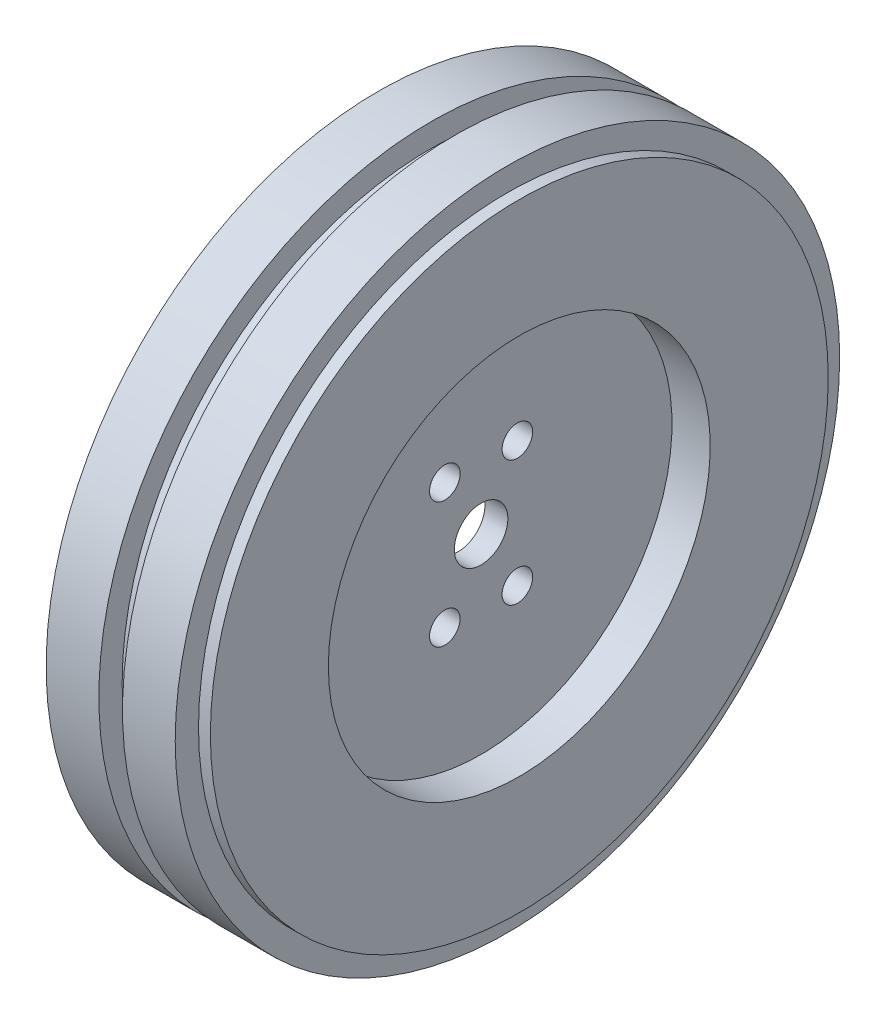
ISO-10303-21;
HEADER;
FILE_DESCRIPTION(('STEP AP214'),'2;1');
FILE_NAME('part.step','',(''),(''),'','','');
FILE_SCHEMA(('AUTOMOTIVE_DESIGN { 1 0 10303 214 1 1 1 1 }'));
ENDSEC;
DATA;
#1=APPLICATION_CONTEXT('core data for automotive mechanical design processes');
#2=APPLICATION_PROTOCOL_DEFINITION('international standard','automotive_design',2000,#1);
#3=PRODUCT_CONTEXT('',#1,'mechanical');
#4=PRODUCT('Part','Part','',(#3));
#5=PRODUCT_RELATED_PRODUCT_CATEGORY('part','',(#4));
#6=PRODUCT_DEFINITION_FORMATION('','',#4);
#7=PRODUCT_DEFINITION_CONTEXT('part definition',#1,'design');
#8=PRODUCT_DEFINITION('design','',#6,#7);
#9=PRODUCT_DEFINITION_SHAPE('','',#8);
#10=(LENGTH_UNIT() NAMED_UNIT(*) SI_UNIT(.MILLI.,.METRE.));
#11=(NAMED_UNIT(*) PLANE_ANGLE_UNIT() SI_UNIT($,.RADIAN.));
#12=(NAMED_UNIT(*) SI_UNIT($,.STERADIAN.) SOLID_ANGLE_UNIT());
#13=UNCERTAINTY_MEASURE_WITH_UNIT(LENGTH_MEASURE(1.E-05),#10,'distance_accuracy_value','');
#14=(GEOMETRIC_REPRESENTATION_CONTEXT(3) GLOBAL_UNCERTAINTY_ASSIGNED_CONTEXT((#13)) GLOBAL_UNIT_ASSIGNED_CONTEXT((#10,
#11,#12)) REPRESENTATION_CONTEXT('',''));
#15=CARTESIAN_POINT('',(0.,0.,0.));
#16=DIRECTION('',(0.,0.,1.));
#17=DIRECTION('',(1.,0.,0.));
#18=AXIS2_PLACEMENT_3D('',#15,#16,#17);
#19=CARTESIAN_POINT('',(8.00000000000001,0.,0.));
#20=DIRECTION('',(-1.,0.,0.));
#21=DIRECTION('',(0.,0.,-1.));
#22=AXIS2_PLACEMENT_3D('',#19,#20,#21);
#23=CYLINDRICAL_SURFACE('',#22,43.5);
#24=CARTESIAN_POINT('',(-0.449999999999995,0.,0.));
#25=DIRECTION('',(1.,0.,0.));
#26=DIRECTION('',(0.,0.,-1.));
#27=AXIS2_PLACEMENT_3D('',#24,#25,#26);
#28=CIRCLE('',#27,43.5);
#29=CARTESIAN_POINT('',(-0.449999999999995,0.,-43.5));
#30=VERTEX_POINT('',#29);
#31=EDGE_CURVE('E98',#30,#30,#28,.T.);
#32=ORIENTED_EDGE('',*,*,#31,.T.);
#33=EDGE_LOOP('',(#32));
#34=FACE_BOUND('',#33,.T.);
#35=CARTESIAN_POINT('',(6.45,0.,0.));
#36=DIRECTION('',(-1.,0.,0.));
#37=DIRECTION('',(0.,0.,1.));
#38=AXIS2_PLACEMENT_3D('',#35,#36,#37);
#39=CIRCLE('',#38,43.5);
#40=CARTESIAN_POINT('',(6.45,0.,43.5));
#41=VERTEX_POINT('',#40);
#42=EDGE_CURVE('E104',#41,#41,#39,.T.);
#43=ORIENTED_EDGE('',*,*,#42,.T.);
#44=EDGE_LOOP('',(#43));
#45=FACE_BOUND('',#44,.T.);
#46=ADVANCED_FACE('F33',(#34,#45),#23,.T.);
#47=CARTESIAN_POINT('',(8.,40.,0.));
#48=DIRECTION('',(-1.,0.,0.));
#49=DIRECTION('',(0.,0.,-1.));
#50=AXIS2_PLACEMENT_3D('',#47,#48,#49);
#51=PLANE('',#50);
#52=CARTESIAN_POINT('',(8.,0.,0.));
#53=DIRECTION('',(-1.,0.,0.));
#54=DIRECTION('',(0.,0.,1.));
#55=AXIS2_PLACEMENT_3D('',#52,#53,#54);
#56=CIRCLE('',#55,25.);
#57=CARTESIAN_POINT('',(8.,0.,25.));
#58=VERTEX_POINT('',#57);
#59=EDGE_CURVE('E78',#58,#58,#56,.T.);
#60=ORIENTED_EDGE('',*,*,#59,.T.);
#61=EDGE_LOOP('',(#60));
#62=FACE_BOUND('',#61,.T.);
#63=CARTESIAN_POINT('',(8.,0.,0.));
#64=DIRECTION('',(-1.,0.,0.));
#65=DIRECTION('',(0.,0.,1.));
#66=AXIS2_PLACEMENT_3D('',#63,#64,#65);
#67=CIRCLE('',#66,40.45);
#68=CARTESIAN_POINT('',(8.00000000000001,0.,40.45));
#69=VERTEX_POINT('',#68);
#70=EDGE_CURVE('E108',#69,#69,#67,.T.);
#71=ORIENTED_EDGE('',*,*,#70,.F.);
#72=EDGE_LOOP('',(#71));
#73=FACE_BOUND('',#72,.T.);
#74=ADVANCED_FACE('F123',(#62,#73),#51,.F.);
#75=CARTESIAN_POINT('',(-12.,0.,0.));
#76=DIRECTION('',(-1.,0.,0.));
#77=DIRECTION('',(0.,0.,-1.));
#78=AXIS2_PLACEMENT_3D('',#75,#76,#77);
#79=PLANE('',#78);
#80=CARTESIAN_POINT('',(-12.,0.,0.));
#81=DIRECTION('',(1.,0.,0.));
#82=DIRECTION('',(0.,0.,-1.));
#83=AXIS2_PLACEMENT_3D('',#80,#81,#82);
#84=CIRCLE('',#83,34.);
#85=CARTESIAN_POINT('',(-12.,0.,-34.));
#86=VERTEX_POINT('',#85);
#87=EDGE_CURVE('E74',#86,#86,#84,.F.);
#88=ORIENTED_EDGE('',*,*,#87,.F.);
#89=EDGE_LOOP('',(#88));
#90=FACE_BOUND('',#89,.T.);
#91=CARTESIAN_POINT('',(-12.,0.,0.));
#92=DIRECTION('',(1.,0.,0.));
#93=DIRECTION('',(0.,0.,-1.));
#94=AXIS2_PLACEMENT_3D('',#91,#92,#93);
#95=CIRCLE('',#94,40.45);
#96=CARTESIAN_POINT('',(-12.,0.,-40.45));
#97=VERTEX_POINT('',#96);
#98=EDGE_CURVE('E87',#97,#97,#95,.T.);
#99=ORIENTED_EDGE('',*,*,#98,.F.);
#100=EDGE_LOOP('',(#99));
#101=FACE_BOUND('',#100,.T.);
#102=ADVANCED_FACE('F125',(#90,#101),#79,.T.);
#103=CARTESIAN_POINT('',(-3.54999999999999,0.,0.));
#104=DIRECTION('',(1.,0.,0.));
#105=DIRECTION('',(0.,0.,-1.));
#106=AXIS2_PLACEMENT_3D('',#103,#104,#105);
#107=CIRCLE('',#106,43.5);
#108=CARTESIAN_POINT('',(-3.54999999999999,0.,-43.5));
#109=VERTEX_POINT('',#108);
#110=EDGE_CURVE('E90',#109,#109,#107,.T.);
#111=ORIENTED_EDGE('',*,*,#110,.F.);
#112=EDGE_LOOP('',(#111));
#113=FACE_BOUND('',#112,.T.);
#114=CARTESIAN_POINT('',(-10.45,0.,0.));
#115=DIRECTION('',(1.,0.,0.));
#116=DIRECTION('',(0.,0.,-1.));
#117=AXIS2_PLACEMENT_3D('',#114,#115,#116);
#118=CIRCLE('',#117,43.5);
#119=CARTESIAN_POINT('',(-10.45,0.,-43.5));
#120=VERTEX_POINT('',#119);
#121=EDGE_CURVE('E81',#120,#120,#118,.T.);
#122=ORIENTED_EDGE('',*,*,#121,.T.);
#123=EDGE_LOOP('',(#122));
#124=FACE_BOUND('',#123,.T.);
#125=ADVANCED_FACE('F131',(#113,#124),#23,.T.);
#126=CARTESIAN_POINT('',(-49.6444990272902,0.,0.));
#127=DIRECTION('',(-1.,0.,0.));
#128=DIRECTION('',(0.,0.,-1.));
#129=AXIS2_PLACEMENT_3D('',#126,#127,#128);
#130=CYLINDRICAL_SURFACE('',#129,34.);
#131=CARTESIAN_POINT('',(0.,0.,0.));
#132=DIRECTION('',(1.,0.,0.));
#133=DIRECTION('',(0.,0.,-1.));
#134=AXIS2_PLACEMENT_3D('',#131,#132,#133);
#135=CIRCLE('',#134,34.);
#136=CARTESIAN_POINT('',(0.,0.,-34.));
#137=VERTEX_POINT('',#136);
#138=EDGE_CURVE('E10',#137,#137,#135,.T.);
#139=ORIENTED_EDGE('',*,*,#138,.T.);
#140=EDGE_LOOP('',(#139));
#141=FACE_BOUND('',#140,.T.);
#142=ORIENTED_EDGE('',*,*,#87,.T.);
#143=EDGE_LOOP('',(#142));
#144=FACE_BOUND('',#143,.T.);
#145=ADVANCED_FACE('F35',(#141,#144),#130,.F.);
#146=CARTESIAN_POINT('',(0.,34.,0.));
#147=DIRECTION('',(1.,0.,0.));
#148=DIRECTION('',(0.,0.,1.));
#149=AXIS2_PLACEMENT_3D('',#146,#147,#148);
#150=PLANE('',#149);
#151=CARTESIAN_POINT('',(0.,0.,0.));
#152=DIRECTION('',(-1.,0.,0.));
#153=DIRECTION('',(0.,0.,1.));
#154=AXIS2_PLACEMENT_3D('',#151,#152,#153);
#155=CIRCLE('',#154,3.5);
#156=CARTESIAN_POINT('',(0.,0.,3.5));
#157=VERTEX_POINT('',#156);
#158=EDGE_CURVE('E68',#157,#157,#155,.T.);
#159=ORIENTED_EDGE('',*,*,#158,.F.);
#160=EDGE_LOOP('',(#159));
#161=FACE_BOUND('',#160,.T.);
#162=CARTESIAN_POINT('',(0.,8.22724133595216,-4.75000000000001));
#163=DIRECTION('',(-1.,0.,0.));
#164=DIRECTION('',(0.,0.,1.));
#165=AXIS2_PLACEMENT_3D('',#162,#163,#164);
#166=CIRCLE('',#165,2.);
#167=CARTESIAN_POINT('',(0.,8.22724133595216,-2.75000000000001));
#168=VERTEX_POINT('',#167);
#169=EDGE_CURVE('E40',#168,#168,#166,.T.);
#170=ORIENTED_EDGE('',*,*,#169,.F.);
#171=EDGE_LOOP('',(#170));
#172=FACE_BOUND('',#171,.T.);
#173=CARTESIAN_POINT('',(0.,-8.22724133595216,4.75000000000001));
#174=DIRECTION('',(-1.,0.,0.));
#175=DIRECTION('',(0.,0.,1.));
#176=AXIS2_PLACEMENT_3D('',#173,#174,#175);
#177=CIRCLE('',#176,2.);
#178=CARTESIAN_POINT('',(0.,-8.22724133595216,6.75000000000001));
#179=VERTEX_POINT('',#178);
#180=EDGE_CURVE('E44',#179,#179,#177,.T.);
#181=ORIENTED_EDGE('',*,*,#180,.F.);
#182=EDGE_LOOP('',(#181));
#183=FACE_BOUND('',#182,.T.);
#184=CARTESIAN_POINT('',(0.,-8.22724133595216,-4.75000000000001));
#185=DIRECTION('',(-1.,0.,0.));
#186=DIRECTION('',(0.,0.,1.));
#187=AXIS2_PLACEMENT_3D('',#184,#185,#186);
#188=CIRCLE('',#187,2.);
#189=CARTESIAN_POINT('',(0.,-8.22724133595216,-2.75000000000001));
#190=VERTEX_POINT('',#189);
#191=EDGE_CURVE('E48',#190,#190,#188,.T.);
#192=ORIENTED_EDGE('',*,*,#191,.F.);
#193=EDGE_LOOP('',(#192));
#194=FACE_BOUND('',#193,.T.);
#195=CARTESIAN_POINT('',(0.,8.22724133595216,4.75000000000001));
#196=DIRECTION('',(-1.,0.,0.));
#197=DIRECTION('',(0.,0.,1.));
#198=AXIS2_PLACEMENT_3D('',#195,#196,#197);
#199=CIRCLE('',#198,2.);
#200=CARTESIAN_POINT('',(0.,8.22724133595216,6.75000000000001));
#201=VERTEX_POINT('',#200);
#202=EDGE_CURVE('E53',#201,#201,#199,.T.);
#203=ORIENTED_EDGE('',*,*,#202,.F.);
#204=EDGE_LOOP('',(#203));
#205=FACE_BOUND('',#204,.T.);
#206=ORIENTED_EDGE('',*,*,#138,.F.);
#207=EDGE_LOOP('',(#206));
#208=FACE_BOUND('',#207,.T.);
#209=ADVANCED_FACE('F137',(#161,#172,#183,#194,#205,#208),#150,.F.);
#210=CARTESIAN_POINT('',(3.,12.5,0.));
#211=DIRECTION('',(1.,0.,0.));
#212=DIRECTION('',(0.,0.,1.));
#213=AXIS2_PLACEMENT_3D('',#210,#211,#212);
#214=PLANE('',#213);
#215=CARTESIAN_POINT('',(3.,0.,0.));
#216=DIRECTION('',(-1.,0.,0.));
#217=DIRECTION('',(0.,0.,1.));
#218=AXIS2_PLACEMENT_3D('',#215,#216,#217);
#219=CIRCLE('',#218,3.5);
#220=CARTESIAN_POINT('',(3.,0.,3.5));
#221=VERTEX_POINT('',#220);
#222=EDGE_CURVE('E71',#221,#221,#219,.T.);
#223=ORIENTED_EDGE('',*,*,#222,.T.);
#224=EDGE_LOOP('',(#223));
#225=FACE_BOUND('',#224,.T.);
#226=CARTESIAN_POINT('',(3.,8.22724133595216,-4.75000000000001));
#227=DIRECTION('',(-1.,0.,0.));
#228=DIRECTION('',(0.,0.,-1.));
#229=AXIS2_PLACEMENT_3D('',#226,#227,#228);
#230=CIRCLE('',#229,2.);
#231=CARTESIAN_POINT('',(3.,8.22724133595216,-6.75000000000001));
#232=VERTEX_POINT('',#231);
#233=EDGE_CURVE('E59',#232,#232,#230,.T.);
#234=ORIENTED_EDGE('',*,*,#233,.T.);
#235=EDGE_LOOP('',(#234));
#236=FACE_BOUND('',#235,.T.);
#237=CARTESIAN_POINT('',(3.,-8.22724133595216,4.75000000000001));
#238=DIRECTION('',(-1.,0.,0.));
#239=DIRECTION('',(0.,0.,-1.));
#240=AXIS2_PLACEMENT_3D('',#237,#238,#239);
#241=CIRCLE('',#240,2.);
#242=CARTESIAN_POINT('',(3.,-8.22724133595216,2.75000000000001));
#243=VERTEX_POINT('',#242);
#244=EDGE_CURVE('E60',#243,#243,#241,.T.);
#245=ORIENTED_EDGE('',*,*,#244,.T.);
#246=EDGE_LOOP('',(#245));
#247=FACE_BOUND('',#246,.T.);
#248=CARTESIAN_POINT('',(3.,-8.22724133595216,-4.75000000000001));
#249=DIRECTION('',(-1.,0.,0.));
#250=DIRECTION('',(0.,0.,1.));
#251=AXIS2_PLACEMENT_3D('',#248,#249,#250);
#252=CIRCLE('',#251,2.);
#253=CARTESIAN_POINT('',(3.,-8.22724133595216,-2.75000000000001));
#254=VERTEX_POINT('',#253);
#255=EDGE_CURVE('E63',#254,#254,#252,.T.);
#256=ORIENTED_EDGE('',*,*,#255,.T.);
#257=EDGE_LOOP('',(#256));
#258=FACE_BOUND('',#257,.T.);
#259=CARTESIAN_POINT('',(3.,8.22724133595216,4.75000000000001));
#260=DIRECTION('',(-1.,0.,0.));
#261=DIRECTION('',(0.,0.,1.));
#262=AXIS2_PLACEMENT_3D('',#259,#260,#261);
#263=CIRCLE('',#262,2.);
#264=CARTESIAN_POINT('',(3.,8.22724133595216,6.75000000000001));
#265=VERTEX_POINT('',#264);
#266=EDGE_CURVE('E56',#265,#265,#263,.T.);
#267=ORIENTED_EDGE('',*,*,#266,.T.);
#268=EDGE_LOOP('',(#267));
#269=FACE_BOUND('',#268,.T.);
#270=CARTESIAN_POINT('',(3.,0.,0.));
#271=DIRECTION('',(-1.,0.,0.));
#272=DIRECTION('',(0.,0.,1.));
#273=AXIS2_PLACEMENT_3D('',#270,#271,#272);
#274=CIRCLE('',#273,25.);
#275=CARTESIAN_POINT('',(3.,0.,25.));
#276=VERTEX_POINT('',#275);
#277=EDGE_CURVE('E77',#276,#276,#274,.T.);
#278=ORIENTED_EDGE('',*,*,#277,.F.);
#279=EDGE_LOOP('',(#278));
#280=FACE_BOUND('',#279,.T.);
#281=ADVANCED_FACE('F140',(#225,#236,#247,#258,#269,#280),#214,.T.);
#282=CARTESIAN_POINT('',(-32.,8.22724133595216,4.75000000000001));
#283=DIRECTION('',(1.,0.,0.));
#284=DIRECTION('',(0.,0.,1.));
#285=AXIS2_PLACEMENT_3D('',#282,#283,#284);
#286=CYLINDRICAL_SURFACE('',#285,2.);
#287=ORIENTED_EDGE('',*,*,#266,.F.);
#288=EDGE_LOOP('',(#287));
#289=FACE_BOUND('',#288,.T.);
#290=ORIENTED_EDGE('',*,*,#202,.T.);
#291=EDGE_LOOP('',(#290));
#292=FACE_BOUND('',#291,.T.);
#293=ADVANCED_FACE('F144',(#289,#292),#286,.F.);
#294=CARTESIAN_POINT('',(-32.,-8.22724133595216,-4.75000000000001));
#295=DIRECTION('',(1.,0.,0.));
#296=DIRECTION('',(0.,0.,1.));
#297=AXIS2_PLACEMENT_3D('',#294,#295,#296);
#298=CYLINDRICAL_SURFACE('',#297,2.);
#299=ORIENTED_EDGE('',*,*,#255,.F.);
#300=EDGE_LOOP('',(#299));
#301=FACE_BOUND('',#300,.T.);
#302=ORIENTED_EDGE('',*,*,#191,.T.);
#303=EDGE_LOOP('',(#302));
#304=FACE_BOUND('',#303,.T.);
#305=ADVANCED_FACE('F148',(#301,#304),#298,.F.);
#306=CARTESIAN_POINT('',(-32.,-8.22724133595216,4.75000000000001));
#307=DIRECTION('',(1.,0.,0.));
#308=DIRECTION('',(0.,0.,1.));
#309=AXIS2_PLACEMENT_3D('',#306,#307,#308);
#310=CYLINDRICAL_SURFACE('',#309,2.);
#311=ORIENTED_EDGE('',*,*,#244,.F.);
#312=EDGE_LOOP('',(#311));
#313=FACE_BOUND('',#312,.T.);
#314=ORIENTED_EDGE('',*,*,#180,.T.);
#315=EDGE_LOOP('',(#314));
#316=FACE_BOUND('',#315,.T.);
#317=ADVANCED_FACE('F150',(#313,#316),#310,.F.);
#318=CARTESIAN_POINT('',(-32.,8.22724133595216,-4.75000000000001));
#319=DIRECTION('',(1.,0.,0.));
#320=DIRECTION('',(0.,0.,1.));
#321=AXIS2_PLACEMENT_3D('',#318,#319,#320);
#322=CYLINDRICAL_SURFACE('',#321,2.);
#323=ORIENTED_EDGE('',*,*,#233,.F.);
#324=EDGE_LOOP('',(#323));
#325=FACE_BOUND('',#324,.T.);
#326=ORIENTED_EDGE('',*,*,#169,.T.);
#327=EDGE_LOOP('',(#326));
#328=FACE_BOUND('',#327,.T.);
#329=ADVANCED_FACE('F153',(#325,#328),#322,.F.);
#330=CARTESIAN_POINT('',(-32.,0.,0.));
#331=DIRECTION('',(1.,0.,0.));
#332=DIRECTION('',(0.,0.,1.));
#333=AXIS2_PLACEMENT_3D('',#330,#331,#332);
#334=CYLINDRICAL_SURFACE('',#333,3.5);
#335=ORIENTED_EDGE('',*,*,#222,.F.);
#336=EDGE_LOOP('',(#335));
#337=FACE_BOUND('',#336,.T.);
#338=ORIENTED_EDGE('',*,*,#158,.T.);
#339=EDGE_LOOP('',(#338));
#340=FACE_BOUND('',#339,.T.);
#341=ADVANCED_FACE('F157',(#337,#340),#334,.F.);
#342=CARTESIAN_POINT('',(3.,0.,0.));
#343=DIRECTION('',(1.,0.,0.));
#344=DIRECTION('',(0.,0.,1.));
#345=AXIS2_PLACEMENT_3D('',#342,#343,#344);
#346=CYLINDRICAL_SURFACE('',#345,25.);
#347=ORIENTED_EDGE('',*,*,#277,.T.);
#348=EDGE_LOOP('',(#347));
#349=FACE_BOUND('',#348,.T.);
#350=ORIENTED_EDGE('',*,*,#59,.F.);
#351=EDGE_LOOP('',(#350));
#352=FACE_BOUND('',#351,.T.);
#353=ADVANCED_FACE('F163',(#349,#352),#346,.F.);
#354=CARTESIAN_POINT('',(-10.45,0.,0.));
#355=DIRECTION('',(-1.,0.,0.));
#356=DIRECTION('',(0.,0.,-1.));
#357=AXIS2_PLACEMENT_3D('',#354,#355,#356);
#358=PLANE('',#357);
#359=CARTESIAN_POINT('',(-10.45,0.,0.));
#360=DIRECTION('',(1.,0.,0.));
#361=DIRECTION('',(0.,0.,-1.));
#362=AXIS2_PLACEMENT_3D('',#359,#360,#361);
#363=CIRCLE('',#362,40.45);
#364=CARTESIAN_POINT('',(-10.45,0.,-40.45));
#365=VERTEX_POINT('',#364);
#366=EDGE_CURVE('E86',#365,#365,#363,.T.);
#367=ORIENTED_EDGE('',*,*,#366,.T.);
#368=EDGE_LOOP('',(#367));
#369=FACE_BOUND('',#368,.T.);
#370=ORIENTED_EDGE('',*,*,#121,.F.);
#371=EDGE_LOOP('',(#370));
#372=FACE_BOUND('',#371,.T.);
#373=ADVANCED_FACE('F167',(#369,#372),#358,.T.);
#374=CARTESIAN_POINT('',(-10.45,0.,0.));
#375=DIRECTION('',(-1.,0.,0.));
#376=DIRECTION('',(0.,0.,-1.));
#377=AXIS2_PLACEMENT_3D('',#374,#375,#376);
#378=CYLINDRICAL_SURFACE('',#377,40.45);
#379=CARTESIAN_POINT('',(-10.45,0.,-40.45));
#380=CARTESIAN_POINT('',(-10.4661458333333,0.,-40.45));
#381=CARTESIAN_POINT('',(-10.4822916666667,0.,-40.45));
#382=CARTESIAN_POINT('',(-10.5145833333333,0.,-40.45));
#383=CARTESIAN_POINT('',(-10.5307291666667,0.,-40.45));
#384=CARTESIAN_POINT('',(-10.5630208333333,0.,-40.45));
#385=CARTESIAN_POINT('',(-10.5791666666667,0.,-40.45));
#386=CARTESIAN_POINT('',(-10.6114583333333,0.,-40.45));
#387=CARTESIAN_POINT('',(-10.6276041666667,0.,-40.45));
#388=CARTESIAN_POINT('',(-10.6598958333333,0.,-40.45));
#389=CARTESIAN_POINT('',(-10.6760416666667,0.,-40.45));
#390=CARTESIAN_POINT('',(-10.7083333333333,0.,-40.45));
#391=CARTESIAN_POINT('',(-10.7244791666667,0.,-40.45));
#392=CARTESIAN_POINT('',(-10.7567708333333,0.,-40.45));
#393=CARTESIAN_POINT('',(-10.7729166666667,0.,-40.45));
#394=CARTESIAN_POINT('',(-10.8052083333333,0.,-40.45));
#395=CARTESIAN_POINT('',(-10.8213541666667,0.,-40.45));
#396=CARTESIAN_POINT('',(-10.8536458333333,0.,-40.45));
#397=CARTESIAN_POINT('',(-10.8697916666667,0.,-40.45));
#398=CARTESIAN_POINT('',(-10.9020833333333,0.,-40.45));
#399=CARTESIAN_POINT('',(-10.9182291666667,0.,-40.45));
#400=CARTESIAN_POINT('',(-10.9505208333333,0.,-40.45));
#401=CARTESIAN_POINT('',(-10.9666666666667,0.,-40.45));
#402=CARTESIAN_POINT('',(-10.9989583333333,0.,-40.45));
#403=CARTESIAN_POINT('',(-11.0151041666667,0.,-40.45));
#404=CARTESIAN_POINT('',(-11.0473958333333,0.,-40.45));
#405=CARTESIAN_POINT('',(-11.0635416666667,0.,-40.45));
#406=CARTESIAN_POINT('',(-11.0958333333333,0.,-40.45));
#407=CARTESIAN_POINT('',(-11.1119791666667,0.,-40.45));
#408=CARTESIAN_POINT('',(-11.1442708333333,0.,-40.45));
#409=CARTESIAN_POINT('',(-11.1604166666667,0.,-40.45));
#410=CARTESIAN_POINT('',(-11.1927083333333,0.,-40.45));
#411=CARTESIAN_POINT('',(-11.2088541666667,0.,-40.45));
#412=CARTESIAN_POINT('',(-11.2411458333333,0.,-40.45));
#413=CARTESIAN_POINT('',(-11.2572916666667,0.,-40.45));
#414=CARTESIAN_POINT('',(-11.2895833333333,0.,-40.45));
#415=CARTESIAN_POINT('',(-11.3057291666667,0.,-40.45));
#416=CARTESIAN_POINT('',(-11.3380208333333,0.,-40.45));
#417=CARTESIAN_POINT('',(-11.3541666666667,0.,-40.45));
#418=CARTESIAN_POINT('',(-11.3864583333333,0.,-40.45));
#419=CARTESIAN_POINT('',(-11.4026041666667,0.,-40.45));
#420=CARTESIAN_POINT('',(-11.4348958333333,0.,-40.45));
#421=CARTESIAN_POINT('',(-11.4510416666667,0.,-40.45));
#422=CARTESIAN_POINT('',(-11.4833333333333,0.,-40.45));
#423=CARTESIAN_POINT('',(-11.4994791666667,0.,-40.45));
#424=CARTESIAN_POINT('',(-11.5317708333333,0.,-40.45));
#425=CARTESIAN_POINT('',(-11.5479166666667,0.,-40.45));
#426=CARTESIAN_POINT('',(-11.5802083333333,0.,-40.45));
#427=CARTESIAN_POINT('',(-11.5963541666667,0.,-40.45));
#428=CARTESIAN_POINT('',(-11.6286458333333,0.,-40.45));
#429=CARTESIAN_POINT('',(-11.6447916666667,0.,-40.45));
#430=CARTESIAN_POINT('',(-11.6770833333333,0.,-40.45));
#431=CARTESIAN_POINT('',(-11.6932291666667,0.,-40.45));
#432=CARTESIAN_POINT('',(-11.7255208333333,0.,-40.45));
#433=CARTESIAN_POINT('',(-11.7416666666667,0.,-40.45));
#434=CARTESIAN_POINT('',(-11.7739583333333,0.,-40.45));
#435=CARTESIAN_POINT('',(-11.7901041666667,0.,-40.45));
#436=CARTESIAN_POINT('',(-11.8223958333333,0.,-40.45));
#437=CARTESIAN_POINT('',(-11.8385416666667,0.,-40.45));
#438=CARTESIAN_POINT('',(-11.8708333333333,0.,-40.45));
#439=CARTESIAN_POINT('',(-11.8869791666667,0.,-40.45));
#440=CARTESIAN_POINT('',(-11.9192708333333,0.,-40.45));
#441=CARTESIAN_POINT('',(-11.9354166666667,0.,-40.45));
#442=CARTESIAN_POINT('',(-11.9677083333333,0.,-40.45));
#443=CARTESIAN_POINT('',(-11.9838541666667,0.,-40.45));
#444=CARTESIAN_POINT('',(-12.,0.,-40.45));
#445=B_SPLINE_CURVE_WITH_KNOTS('',3,(#379,#380,#381,#382,#383,#384,#385,#386,#387,#388,#389,
#390,#391,#392,#393,#394,#395,#396,#397,#398,#399,#400,#401,#402,#403,#404,#405,#406,#407,#408,
#409,#410,#411,#412,#413,#414,#415,#416,#417,#418,#419,#420,#421,#422,#423,#424,#425,#426,#427,
#428,#429,#430,#431,#432,#433,#434,#435,#436,#437,#438,#439,#440,#441,#442,#443,#444),
.UNSPECIFIED.,.F.,.F.,(4,2,2,2,2,2,2,2,2,2,2,2,2,2,2,2,2,2,2,2,2,2,2,2,2,2,2,2,2,2,2,2,4),(0.,
0.0484375000000016,0.0968750000000015,0.145312500000001,0.193750000000001,0.242187500000001,
0.290625000000001,0.339062500000001,0.387500000000001,0.435937500000001,0.484375,0.5328125,
0.58125,0.6296875,0.678125,0.7265625,0.775000000000001,0.823437500000001,0.871875000000001,
0.920312500000001,0.968750000000001,1.0171875,1.065625,1.1140625,1.1625,1.2109375,1.259375,
1.3078125,1.35625,1.4046875,1.453125,1.5015625,1.55),.UNSPECIFIED.);
#446=EDGE_CURVE('BSEAM174',#365,#97,#445,.T.);
#447=ORIENTED_EDGE('',*,*,#366,.F.);
#448=ORIENTED_EDGE('',*,*,#98,.T.);
#449=ORIENTED_EDGE('',*,*,#446,.T.);
#450=ORIENTED_EDGE('',*,*,#446,.F.);
#451=EDGE_LOOP('',(#447,#449,#448,#450));
#452=FACE_BOUND('',#451,.T.);
#453=ADVANCED_FACE('F174',(#452),#378,.T.);
#454=CARTESIAN_POINT('',(-3.54999999999999,0.,0.));
#455=DIRECTION('',(-1.,0.,0.));
#456=DIRECTION('',(0.,0.,-1.));
#457=AXIS2_PLACEMENT_3D('',#454,#455,#456);
#458=PLANE('',#457);
#459=ORIENTED_EDGE('',*,*,#110,.T.);
#460=EDGE_LOOP('',(#459));
#461=FACE_BOUND('',#460,.T.);
#462=CARTESIAN_POINT('',(-3.54999999999999,0.,0.));
#463=DIRECTION('',(1.,0.,0.));
#464=DIRECTION('',(0.,0.,-1.));
#465=AXIS2_PLACEMENT_3D('',#462,#463,#464);
#466=CIRCLE('',#465,40.45);
#467=CARTESIAN_POINT('',(-3.54999999999999,0.,40.45));
#468=VERTEX_POINT('',#467);
#469=EDGE_CURVE('E95',#468,#468,#466,.T.);
#470=ORIENTED_EDGE('',*,*,#469,.F.);
#471=EDGE_LOOP('',(#470));
#472=FACE_BOUND('',#471,.T.);
#473=ADVANCED_FACE('F178',(#461,#472),#458,.F.);
#474=CARTESIAN_POINT('',(-3.54999999999999,0.,0.));
#475=DIRECTION('',(1.,0.,0.));
#476=DIRECTION('',(0.,0.,1.));
#477=AXIS2_PLACEMENT_3D('',#474,#475,#476);
#478=CYLINDRICAL_SURFACE('',#477,40.45);
#479=CARTESIAN_POINT('',(-0.449999999999995,0.,0.));
#480=DIRECTION('',(1.,0.,0.));
#481=DIRECTION('',(0.,0.,-1.));
#482=AXIS2_PLACEMENT_3D('',#479,#480,#481);
#483=CIRCLE('',#482,40.45);
#484=CARTESIAN_POINT('',(-0.449999999999995,0.,40.45));
#485=VERTEX_POINT('',#484);
#486=EDGE_CURVE('E101',#485,#485,#483,.T.);
#487=CARTESIAN_POINT('',(-3.54999999999999,0.,40.45));
#488=CARTESIAN_POINT('',(-3.51770833333333,0.,40.45));
#489=CARTESIAN_POINT('',(-3.48541666666666,0.,40.45));
#490=CARTESIAN_POINT('',(-3.42083333333333,0.,40.45));
#491=CARTESIAN_POINT('',(-3.38854166666666,0.,40.45));
#492=CARTESIAN_POINT('',(-3.32395833333333,0.,40.45));
#493=CARTESIAN_POINT('',(-3.29166666666666,0.,40.45));
#494=CARTESIAN_POINT('',(-3.22708333333333,0.,40.45));
#495=CARTESIAN_POINT('',(-3.19479166666666,0.,40.45));
#496=CARTESIAN_POINT('',(-3.13020833333333,0.,40.45));
#497=CARTESIAN_POINT('',(-3.09791666666666,0.,40.45));
#498=CARTESIAN_POINT('',(-3.03333333333333,0.,40.45));
#499=CARTESIAN_POINT('',(-3.00104166666666,0.,40.45));
#500=CARTESIAN_POINT('',(-2.93645833333333,0.,40.45));
#501=CARTESIAN_POINT('',(-2.90416666666666,0.,40.45));
#502=CARTESIAN_POINT('',(-2.83958333333333,0.,40.45));
#503=CARTESIAN_POINT('',(-2.80729166666666,0.,40.45));
#504=CARTESIAN_POINT('',(-2.74270833333333,0.,40.45));
#505=CARTESIAN_POINT('',(-2.71041666666666,0.,40.45));
#506=CARTESIAN_POINT('',(-2.64583333333333,0.,40.45));
#507=CARTESIAN_POINT('',(-2.61354166666666,0.,40.45));
#508=CARTESIAN_POINT('',(-2.54895833333333,0.,40.45));
#509=CARTESIAN_POINT('',(-2.51666666666666,0.,40.45));
#510=CARTESIAN_POINT('',(-2.45208333333333,0.,40.45));
#511=CARTESIAN_POINT('',(-2.41979166666666,0.,40.45));
#512=CARTESIAN_POINT('',(-2.35520833333333,0.,40.45));
#513=CARTESIAN_POINT('',(-2.32291666666666,0.,40.45));
#514=CARTESIAN_POINT('',(-2.25833333333333,0.,40.45));
#515=CARTESIAN_POINT('',(-2.22604166666666,0.,40.45));
#516=CARTESIAN_POINT('',(-2.16145833333333,0.,40.45));
#517=CARTESIAN_POINT('',(-2.12916666666666,0.,40.45));
#518=CARTESIAN_POINT('',(-2.06458333333333,0.,40.45));
#519=CARTESIAN_POINT('',(-2.03229166666666,0.,40.45));
#520=CARTESIAN_POINT('',(-1.96770833333333,0.,40.45));
#521=CARTESIAN_POINT('',(-1.93541666666666,0.,40.45));
#522=CARTESIAN_POINT('',(-1.87083333333333,0.,40.45));
#523=CARTESIAN_POINT('',(-1.83854166666666,0.,40.45));
#524=CARTESIAN_POINT('',(-1.77395833333333,0.,40.45));
#525=CARTESIAN_POINT('',(-1.74166666666666,0.,40.45));
#526=CARTESIAN_POINT('',(-1.67708333333333,0.,40.45));
#527=CARTESIAN_POINT('',(-1.64479166666666,0.,40.45));
#528=CARTESIAN_POINT('',(-1.58020833333333,0.,40.45));
#529=CARTESIAN_POINT('',(-1.54791666666666,0.,40.45));
#530=CARTESIAN_POINT('',(-1.48333333333333,0.,40.45));
#531=CARTESIAN_POINT('',(-1.45104166666666,0.,40.45));
#532=CARTESIAN_POINT('',(-1.38645833333333,0.,40.45));
#533=CARTESIAN_POINT('',(-1.35416666666666,0.,40.45));
#534=CARTESIAN_POINT('',(-1.28958333333333,0.,40.45));
#535=CARTESIAN_POINT('',(-1.25729166666666,0.,40.45));
#536=CARTESIAN_POINT('',(-1.19270833333333,0.,40.45));
#537=CARTESIAN_POINT('',(-1.16041666666666,0.,40.45));
#538=CARTESIAN_POINT('',(-1.09583333333333,0.,40.45));
#539=CARTESIAN_POINT('',(-1.06354166666666,0.,40.45));
#540=CARTESIAN_POINT('',(-0.998958333333329,0.,40.45));
#541=CARTESIAN_POINT('',(-0.966666666666662,0.,40.45));
#542=CARTESIAN_POINT('',(-0.902083333333328,0.,40.45));
#543=CARTESIAN_POINT('',(-0.869791666666662,0.,40.45));
#544=CARTESIAN_POINT('',(-0.805208333333328,0.,40.45));
#545=CARTESIAN_POINT('',(-0.772916666666662,0.,40.45));
#546=CARTESIAN_POINT('',(-0.708333333333328,0.,40.45));
#547=CARTESIAN_POINT('',(-0.676041666666662,0.,40.45));
#548=CARTESIAN_POINT('',(-0.611458333333328,0.,40.45));
#549=CARTESIAN_POINT('',(-0.579166666666662,0.,40.45));
#550=CARTESIAN_POINT('',(-0.514583333333329,0.,40.45));
#551=CARTESIAN_POINT('',(-0.482291666666662,0.,40.45));
#552=CARTESIAN_POINT('',(-0.449999999999995,0.,40.45));
#553=B_SPLINE_CURVE_WITH_KNOTS('',3,(#487,#488,#489,#490,#491,#492,#493,#494,#495,#496,#497,
#498,#499,#500,#501,#502,#503,#504,#505,#506,#507,#508,#509,#510,#511,#512,#513,#514,#515,#516,
#517,#518,#519,#520,#521,#522,#523,#524,#525,#526,#527,#528,#529,#530,#531,#532,#533,#534,#535,
#536,#537,#538,#539,#540,#541,#542,#543,#544,#545,#546,#547,#548,#549,#550,#551,#552),
.UNSPECIFIED.,.F.,.F.,(4,2,2,2,2,2,2,2,2,2,2,2,2,2,2,2,2,2,2,2,2,2,2,2,2,2,2,2,2,2,2,2,4),(0.,
0.0968749999999997,0.19375,0.290625,0.3875,0.484375,0.58125,0.678125,0.775,0.871875,0.96875,
1.065625,1.1625,1.259375,1.35625,1.453125,1.55,1.646875,1.74375,1.840625,1.9375,2.034375,
2.13125,2.228125,2.325,2.421875,2.51875,2.615625,2.7125,2.809375,2.90625,3.003125,3.1),.UNSPECIFIED.);
#554=EDGE_CURVE('BSEAM182',#468,#485,#553,.T.);
#555=ORIENTED_EDGE('',*,*,#469,.T.);
#556=ORIENTED_EDGE('',*,*,#486,.F.);
#557=ORIENTED_EDGE('',*,*,#554,.T.);
#558=ORIENTED_EDGE('',*,*,#554,.F.);
#559=EDGE_LOOP('',(#555,#557,#556,#558));
#560=FACE_BOUND('',#559,.T.);
#561=ADVANCED_FACE('F182',(#560),#478,.T.);
#562=CARTESIAN_POINT('',(-0.449999999999995,0.,0.));
#563=DIRECTION('',(-1.,0.,0.));
#564=DIRECTION('',(0.,0.,-1.));
#565=AXIS2_PLACEMENT_3D('',#562,#563,#564);
#566=PLANE('',#565);
#567=ORIENTED_EDGE('',*,*,#486,.T.);
#568=EDGE_LOOP('',(#567));
#569=FACE_BOUND('',#568,.T.);
#570=ORIENTED_EDGE('',*,*,#31,.F.);
#571=EDGE_LOOP('',(#570));
#572=FACE_BOUND('',#571,.T.);
#573=ADVANCED_FACE('F186',(#569,#572),#566,.T.);
#574=CARTESIAN_POINT('',(6.45,0.,0.));
#575=DIRECTION('',(1.,0.,0.));
#576=DIRECTION('',(0.,0.,1.));
#577=AXIS2_PLACEMENT_3D('',#574,#575,#576);
#578=PLANE('',#577);
#579=CARTESIAN_POINT('',(6.45,0.,0.));
#580=DIRECTION('',(-1.,0.,0.));
#581=DIRECTION('',(0.,0.,1.));
#582=AXIS2_PLACEMENT_3D('',#579,#580,#581);
#583=CIRCLE('',#582,40.45);
#584=CARTESIAN_POINT('',(6.45,0.,40.45));
#585=VERTEX_POINT('',#584);
#586=EDGE_CURVE('E107',#585,#585,#583,.T.);
#587=ORIENTED_EDGE('',*,*,#586,.T.);
#588=EDGE_LOOP('',(#587));
#589=FACE_BOUND('',#588,.T.);
#590=ORIENTED_EDGE('',*,*,#42,.F.);
#591=EDGE_LOOP('',(#590));
#592=FACE_BOUND('',#591,.T.);
#593=ADVANCED_FACE('F114',(#589,#592),#578,.T.);
#594=CARTESIAN_POINT('',(6.45,0.,0.));
#595=DIRECTION('',(1.,0.,0.));
#596=DIRECTION('',(0.,0.,1.));
#597=AXIS2_PLACEMENT_3D('',#594,#595,#596);
#598=CYLINDRICAL_SURFACE('',#597,40.45);
#599=CARTESIAN_POINT('',(6.45,0.,40.45));
#600=CARTESIAN_POINT('',(6.46614583333334,0.,40.45));
#601=CARTESIAN_POINT('',(6.48229166666667,0.,40.45));
#602=CARTESIAN_POINT('',(6.51458333333334,0.,40.45));
#603=CARTESIAN_POINT('',(6.53072916666667,0.,40.45));
#604=CARTESIAN_POINT('',(6.56302083333334,0.,40.45));
#605=CARTESIAN_POINT('',(6.57916666666667,0.,40.45));
#606=CARTESIAN_POINT('',(6.61145833333334,0.,40.45));
#607=CARTESIAN_POINT('',(6.62760416666667,0.,40.45));
#608=CARTESIAN_POINT('',(6.65989583333334,0.,40.45));
#609=CARTESIAN_POINT('',(6.67604166666667,0.,40.45));
#610=CARTESIAN_POINT('',(6.70833333333334,0.,40.45));
#611=CARTESIAN_POINT('',(6.72447916666667,0.,40.45));
#612=CARTESIAN_POINT('',(6.75677083333334,0.,40.45));
#613=CARTESIAN_POINT('',(6.77291666666667,0.,40.45));
#614=CARTESIAN_POINT('',(6.80520833333334,0.,40.45));
#615=CARTESIAN_POINT('',(6.82135416666667,0.,40.45));
#616=CARTESIAN_POINT('',(6.85364583333334,0.,40.45));
#617=CARTESIAN_POINT('',(6.86979166666667,0.,40.45));
#618=CARTESIAN_POINT('',(6.90208333333334,0.,40.45));
#619=CARTESIAN_POINT('',(6.91822916666667,0.,40.45));
#620=CARTESIAN_POINT('',(6.95052083333334,0.,40.45));
#621=CARTESIAN_POINT('',(6.96666666666667,0.,40.45));
#622=CARTESIAN_POINT('',(6.99895833333334,0.,40.45));
#623=CARTESIAN_POINT('',(7.01510416666667,0.,40.45));
#624=CARTESIAN_POINT('',(7.04739583333334,0.,40.45));
#625=CARTESIAN_POINT('',(7.06354166666667,0.,40.45));
#626=CARTESIAN_POINT('',(7.09583333333334,0.,40.45));
#627=CARTESIAN_POINT('',(7.11197916666667,0.,40.45));
#628=CARTESIAN_POINT('',(7.14427083333334,0.,40.45));
#629=CARTESIAN_POINT('',(7.16041666666667,0.,40.45));
#630=CARTESIAN_POINT('',(7.19270833333334,0.,40.45));
#631=CARTESIAN_POINT('',(7.20885416666667,0.,40.45));
#632=CARTESIAN_POINT('',(7.24114583333334,0.,40.45));
#633=CARTESIAN_POINT('',(7.25729166666667,0.,40.45));
#634=CARTESIAN_POINT('',(7.28958333333334,0.,40.45));
#635=CARTESIAN_POINT('',(7.30572916666667,0.,40.45));
#636=CARTESIAN_POINT('',(7.33802083333334,0.,40.45));
#637=CARTESIAN_POINT('',(7.35416666666667,0.,40.45));
#638=CARTESIAN_POINT('',(7.38645833333334,0.,40.45));
#639=CARTESIAN_POINT('',(7.40260416666667,0.,40.45));
#640=CARTESIAN_POINT('',(7.43489583333334,0.,40.45));
#641=CARTESIAN_POINT('',(7.45104166666667,0.,40.45));
#642=CARTESIAN_POINT('',(7.48333333333334,0.,40.45));
#643=CARTESIAN_POINT('',(7.49947916666667,0.,40.45));
#644=CARTESIAN_POINT('',(7.53177083333334,0.,40.45));
#645=CARTESIAN_POINT('',(7.54791666666667,0.,40.45));
#646=CARTESIAN_POINT('',(7.58020833333334,0.,40.45));
#647=CARTESIAN_POINT('',(7.59635416666667,0.,40.45));
#648=CARTESIAN_POINT('',(7.62864583333334,0.,40.45));
#649=CARTESIAN_POINT('',(7.64479166666667,0.,40.45));
#650=CARTESIAN_POINT('',(7.67708333333334,0.,40.45));
#651=CARTESIAN_POINT('',(7.69322916666667,0.,40.45));
#652=CARTESIAN_POINT('',(7.72552083333334,0.,40.45));
#653=CARTESIAN_POINT('',(7.74166666666667,0.,40.45));
#654=CARTESIAN_POINT('',(7.77395833333334,0.,40.45));
#655=CARTESIAN_POINT('',(7.79010416666667,0.,40.45));
#656=CARTESIAN_POINT('',(7.82239583333334,0.,40.45));
#657=CARTESIAN_POINT('',(7.83854166666667,0.,40.45));
#658=CARTESIAN_POINT('',(7.87083333333334,0.,40.45));
#659=CARTESIAN_POINT('',(7.88697916666667,0.,40.45));
#660=CARTESIAN_POINT('',(7.91927083333334,0.,40.45));
#661=CARTESIAN_POINT('',(7.93541666666667,0.,40.45));
#662=CARTESIAN_POINT('',(7.96770833333334,0.,40.45));
#663=CARTESIAN_POINT('',(7.98385416666667,0.,40.45));
#664=CARTESIAN_POINT('',(8.00000000000001,0.,40.45));
#665=B_SPLINE_CURVE_WITH_KNOTS('',3,(#599,#600,#601,#602,#603,#604,#605,#606,#607,#608,#609,
#610,#611,#612,#613,#614,#615,#616,#617,#618,#619,#620,#621,#622,#623,#624,#625,#626,#627,#628,
#629,#630,#631,#632,#633,#634,#635,#636,#637,#638,#639,#640,#641,#642,#643,#644,#645,#646,#647,
#648,#649,#650,#651,#652,#653,#654,#655,#656,#657,#658,#659,#660,#661,#662,#663,#664),
.UNSPECIFIED.,.F.,.F.,(4,2,2,2,2,2,2,2,2,2,2,2,2,2,2,2,2,2,2,2,2,2,2,2,2,2,2,2,2,2,2,2,4),(0.,
0.0484374999999999,0.0968749999999997,0.1453125,0.193749999999999,0.242187499999999,0.290625,
0.3390625,0.3875,0.4359375,0.484375,0.532812499999999,0.58125,0.6296875,0.678125,0.7265625,
0.775,0.8234375,0.871875,0.9203125,0.96875,1.0171875,1.065625,1.1140625,1.1625,1.2109375,
1.259375,1.3078125,1.35625,1.4046875,1.453125,1.5015625,1.55),.UNSPECIFIED.);
#666=EDGE_CURVE('BSEAM117',#585,#69,#665,.T.);
#667=ORIENTED_EDGE('',*,*,#586,.F.);
#668=ORIENTED_EDGE('',*,*,#70,.T.);
#669=ORIENTED_EDGE('',*,*,#666,.T.);
#670=ORIENTED_EDGE('',*,*,#666,.F.);
#671=EDGE_LOOP('',(#667,#669,#668,#670));
#672=FACE_BOUND('',#671,.T.);
#673=ADVANCED_FACE('F117',(#672),#598,.T.);
#674=CLOSED_SHELL('',(#46,#74,#102,#125,#145,#209,#281,#293,#305,#317,#329,#341,#353,#373,#453,
#473,#561,#573,#593,#673));
#675=MANIFOLD_SOLID_BREP('B2',#674);
#676=ADVANCED_BREP_SHAPE_REPRESENTATION('',(#18,#675),#14);
#677=SHAPE_DEFINITION_REPRESENTATION(#9,#676);
ENDSEC;
END-ISO-10303-21;
